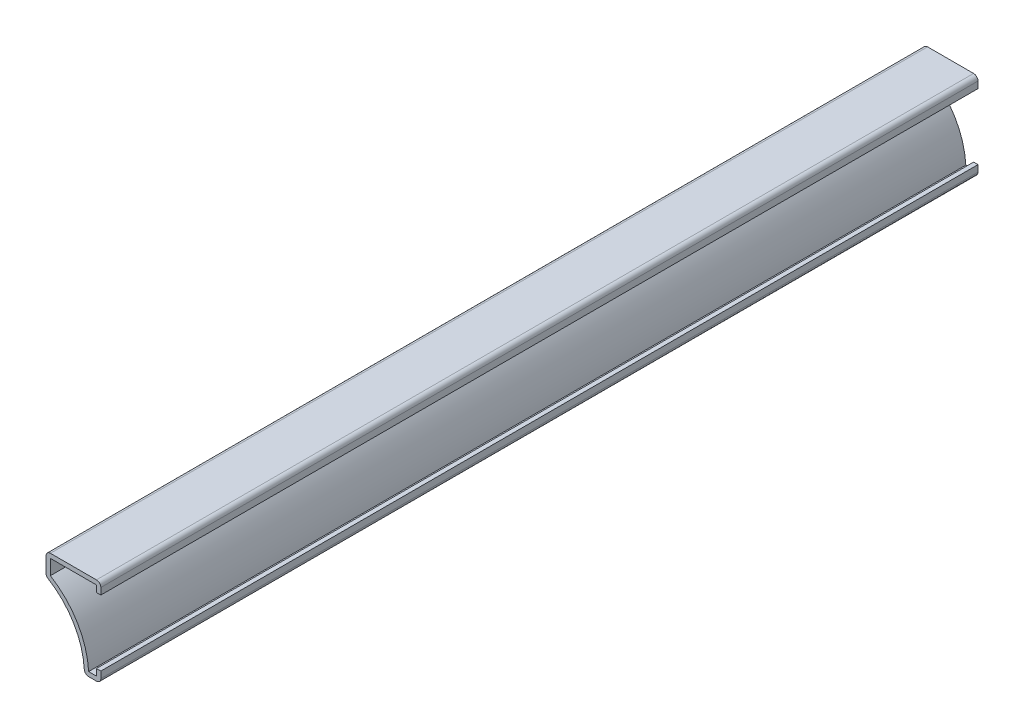
ISO-10303-21;
HEADER;
FILE_DESCRIPTION(('STEP AP214'),'2;1');
FILE_NAME('part.step','',(''),(''),'','','');
FILE_SCHEMA(('AUTOMOTIVE_DESIGN { 1 0 10303 214 1 1 1 1 }'));
ENDSEC;
DATA;
#1=APPLICATION_CONTEXT('core data for automotive mechanical design processes');
#2=APPLICATION_PROTOCOL_DEFINITION('international standard','automotive_design',2000,#1);
#3=PRODUCT_CONTEXT('',#1,'mechanical');
#4=PRODUCT('Part','Part','',(#3));
#5=PRODUCT_RELATED_PRODUCT_CATEGORY('part','',(#4));
#6=PRODUCT_DEFINITION_FORMATION('','',#4);
#7=PRODUCT_DEFINITION_CONTEXT('part definition',#1,'design');
#8=PRODUCT_DEFINITION('design','',#6,#7);
#9=PRODUCT_DEFINITION_SHAPE('','',#8);
#10=(LENGTH_UNIT() NAMED_UNIT(*) SI_UNIT(.MILLI.,.METRE.));
#11=(NAMED_UNIT(*) PLANE_ANGLE_UNIT() SI_UNIT($,.RADIAN.));
#12=(NAMED_UNIT(*) SI_UNIT($,.STERADIAN.) SOLID_ANGLE_UNIT());
#13=UNCERTAINTY_MEASURE_WITH_UNIT(LENGTH_MEASURE(1.E-05),#10,'distance_accuracy_value','');
#14=(GEOMETRIC_REPRESENTATION_CONTEXT(3) GLOBAL_UNCERTAINTY_ASSIGNED_CONTEXT((#13)) GLOBAL_UNIT_ASSIGNED_CONTEXT((#10,
#11,#12)) REPRESENTATION_CONTEXT('',''));
#15=CARTESIAN_POINT('',(0.,0.,0.));
#16=DIRECTION('',(0.,0.,1.));
#17=DIRECTION('',(1.,0.,0.));
#18=AXIS2_PLACEMENT_3D('',#15,#16,#17);
#19=CARTESIAN_POINT('',(-1.27,22.225,-254.));
#20=DIRECTION('',(-1.,0.,0.));
#21=DIRECTION('',(0.,-1.,0.));
#22=AXIS2_PLACEMENT_3D('',#19,#20,#21);
#23=PLANE('',#22);
#24=DIRECTION('',(0.,-1.,0.));
#25=VECTOR('',#24,1.);
#26=CARTESIAN_POINT('',(-1.27,22.225,0.));
#27=LINE('',#26,#25);
#28=CARTESIAN_POINT('',(-1.27,20.955,0.));
#29=VERTEX_POINT('',#28);
#30=CARTESIAN_POINT('',(-1.27,19.05,0.));
#31=VERTEX_POINT('',#30);
#32=EDGE_CURVE('E227',#29,#31,#27,.T.);
#33=ORIENTED_EDGE('',*,*,#32,.F.);
#34=DIRECTION('',(0.,0.,1.));
#35=VECTOR('',#34,1.);
#36=CARTESIAN_POINT('',(-1.27,20.955,-254.));
#37=LINE('',#36,#35);
#38=CARTESIAN_POINT('',(-1.27,20.955,-254.));
#39=VERTEX_POINT('',#38);
#40=EDGE_CURVE('E191',#39,#29,#37,.T.);
#41=ORIENTED_EDGE('',*,*,#40,.F.);
#42=DIRECTION('',(0.,-1.,0.));
#43=VECTOR('',#42,1.);
#44=CARTESIAN_POINT('',(-1.27,22.225,-254.));
#45=LINE('',#44,#43);
#46=CARTESIAN_POINT('',(-1.27,19.05,-254.));
#47=VERTEX_POINT('',#46);
#48=EDGE_CURVE('E173',#39,#47,#45,.T.);
#49=ORIENTED_EDGE('',*,*,#48,.T.);
#50=DIRECTION('',(0.,0.,1.));
#51=VECTOR('',#50,1.);
#52=CARTESIAN_POINT('',(-1.27,19.05,-254.));
#53=LINE('',#52,#51);
#54=EDGE_CURVE('E181',#47,#31,#53,.T.);
#55=ORIENTED_EDGE('',*,*,#54,.T.);
#56=EDGE_LOOP('',(#33,#41,#49,#55));
#57=FACE_BOUND('',#56,.T.);
#58=ADVANCED_FACE('F35',(#57),#23,.T.);
#59=CARTESIAN_POINT('',(-15.875,20.955,-254.));
#60=DIRECTION('',(0.,-1.,0.));
#61=DIRECTION('',(1.,0.,0.));
#62=AXIS2_PLACEMENT_3D('',#59,#60,#61);
#63=PLANE('',#62);
#64=DIRECTION('',(1.,0.,0.));
#65=VECTOR('',#64,1.);
#66=CARTESIAN_POINT('',(-15.875,20.955,0.));
#67=LINE('',#66,#65);
#68=CARTESIAN_POINT('',(-14.605,20.955,0.));
#69=VERTEX_POINT('',#68);
#70=EDGE_CURVE('E192',#69,#29,#67,.T.);
#71=ORIENTED_EDGE('',*,*,#70,.F.);
#72=DIRECTION('',(0.,0.,1.));
#73=VECTOR('',#72,1.);
#74=CARTESIAN_POINT('',(-14.605,20.955,-254.));
#75=LINE('',#74,#73);
#76=CARTESIAN_POINT('',(-14.605,20.955,-254.));
#77=VERTEX_POINT('',#76);
#78=EDGE_CURVE('E261',#77,#69,#75,.T.);
#79=ORIENTED_EDGE('',*,*,#78,.F.);
#80=DIRECTION('',(1.,0.,0.));
#81=VECTOR('',#80,1.);
#82=CARTESIAN_POINT('',(-15.875,20.955,-254.));
#83=LINE('',#82,#81);
#84=EDGE_CURVE('E189',#77,#39,#83,.T.);
#85=ORIENTED_EDGE('',*,*,#84,.T.);
#86=ORIENTED_EDGE('',*,*,#40,.T.);
#87=EDGE_LOOP('',(#71,#79,#85,#86));
#88=FACE_BOUND('',#87,.T.);
#89=ADVANCED_FACE('F328',(#88),#63,.T.);
#90=CARTESIAN_POINT('',(-14.605,15.875,-254.));
#91=DIRECTION('',(1.,0.,0.));
#92=DIRECTION('',(0.,0.,-1.));
#93=AXIS2_PLACEMENT_3D('',#90,#91,#92);
#94=PLANE('',#93);
#95=DIRECTION('',(0.,1.,0.));
#96=VECTOR('',#95,1.);
#97=CARTESIAN_POINT('',(-14.605,15.875,0.));
#98=LINE('',#97,#96);
#99=CARTESIAN_POINT('',(-14.605,16.6019626080447,0.));
#100=VERTEX_POINT('',#99);
#101=EDGE_CURVE('E195',#100,#69,#98,.T.);
#102=ORIENTED_EDGE('',*,*,#101,.F.);
#103=DIRECTION('',(0.,0.,1.));
#104=VECTOR('',#103,1.);
#105=CARTESIAN_POINT('',(-14.605,16.6019626080447,-254.));
#106=LINE('',#105,#104);
#107=CARTESIAN_POINT('',(-14.605,16.6019626080447,-254.));
#108=VERTEX_POINT('',#107);
#109=EDGE_CURVE('E263',#108,#100,#106,.T.);
#110=ORIENTED_EDGE('',*,*,#109,.F.);
#111=DIRECTION('',(0.,1.,0.));
#112=VECTOR('',#111,1.);
#113=CARTESIAN_POINT('',(-14.605,15.875,-254.));
#114=LINE('',#113,#112);
#115=EDGE_CURVE('E223',#108,#77,#114,.T.);
#116=ORIENTED_EDGE('',*,*,#115,.T.);
#117=ORIENTED_EDGE('',*,*,#78,.T.);
#118=EDGE_LOOP('',(#102,#110,#116,#117));
#119=FACE_BOUND('',#118,.T.);
#120=ADVANCED_FACE('F389',(#119),#94,.T.);
#121=CARTESIAN_POINT('',(-26.6473214285714,-3.175,-254.));
#122=DIRECTION('',(0.,0.,1.));
#123=DIRECTION('',(1.,0.,0.));
#124=AXIS2_PLACEMENT_3D('',#121,#122,#123);
#125=CYLINDRICAL_SURFACE('',#124,23.1548214285714);
#126=CARTESIAN_POINT('',(-26.6473214285714,-3.175,0.));
#127=DIRECTION('',(0.,0.,1.));
#128=DIRECTION('',(1.,0.,0.));
#129=AXIS2_PLACEMENT_3D('',#126,#127,#128);
#130=CIRCLE('',#129,23.1548214285714);
#131=CARTESIAN_POINT('',(-3.52735483281202,-1.905,0.));
#132=VERTEX_POINT('',#131);
#133=EDGE_CURVE('E254',#132,#100,#130,.T.);
#134=ORIENTED_EDGE('',*,*,#133,.F.);
#135=DIRECTION('',(0.,0.,1.));
#136=VECTOR('',#135,1.);
#137=CARTESIAN_POINT('',(-3.52735483281202,-1.905,-254.));
#138=LINE('',#137,#136);
#139=CARTESIAN_POINT('',(-3.52735483281202,-1.905,-254.));
#140=VERTEX_POINT('',#139);
#141=EDGE_CURVE('E265',#140,#132,#138,.T.);
#142=ORIENTED_EDGE('',*,*,#141,.F.);
#143=CARTESIAN_POINT('',(-26.6473214285714,-3.175,-254.));
#144=DIRECTION('',(0.,0.,1.));
#145=DIRECTION('',(1.,0.,0.));
#146=AXIS2_PLACEMENT_3D('',#143,#144,#145);
#147=CIRCLE('',#146,23.1548214285714);
#148=EDGE_CURVE('E220',#140,#108,#147,.T.);
#149=ORIENTED_EDGE('',*,*,#148,.T.);
#150=ORIENTED_EDGE('',*,*,#109,.T.);
#151=EDGE_LOOP('',(#134,#142,#149,#150));
#152=FACE_BOUND('',#151,.T.);
#153=ADVANCED_FACE('F335',(#152),#125,.T.);
#154=CARTESIAN_POINT('',(0.,-1.905,-254.));
#155=DIRECTION('',(0.,1.,0.));
#156=DIRECTION('',(-1.,0.,0.));
#157=AXIS2_PLACEMENT_3D('',#154,#155,#156);
#158=PLANE('',#157);
#159=DIRECTION('',(-1.,0.,0.));
#160=VECTOR('',#159,1.);
#161=CARTESIAN_POINT('',(0.,-1.905,0.));
#162=LINE('',#161,#160);
#163=CARTESIAN_POINT('',(-1.27,-1.905,0.));
#164=VERTEX_POINT('',#163);
#165=EDGE_CURVE('E251',#164,#132,#162,.T.);
#166=ORIENTED_EDGE('',*,*,#165,.F.);
#167=DIRECTION('',(0.,0.,1.));
#168=VECTOR('',#167,1.);
#169=CARTESIAN_POINT('',(-1.27,-1.905,-254.));
#170=LINE('',#169,#168);
#171=CARTESIAN_POINT('',(-1.27,-1.905,-254.));
#172=VERTEX_POINT('',#171);
#173=EDGE_CURVE('E267',#172,#164,#170,.T.);
#174=ORIENTED_EDGE('',*,*,#173,.F.);
#175=DIRECTION('',(-1.,0.,0.));
#176=VECTOR('',#175,1.);
#177=CARTESIAN_POINT('',(0.,-1.905,-254.));
#178=LINE('',#177,#176);
#179=EDGE_CURVE('E217',#172,#140,#178,.T.);
#180=ORIENTED_EDGE('',*,*,#179,.T.);
#181=ORIENTED_EDGE('',*,*,#141,.T.);
#182=EDGE_LOOP('',(#166,#174,#180,#181));
#183=FACE_BOUND('',#182,.T.);
#184=ADVANCED_FACE('F338',(#183),#158,.T.);
#185=CARTESIAN_POINT('',(-1.27,0.,-254.));
#186=DIRECTION('',(-1.,0.,0.));
#187=DIRECTION('',(0.,-1.,0.));
#188=AXIS2_PLACEMENT_3D('',#185,#186,#187);
#189=PLANE('',#188);
#190=DIRECTION('',(0.,-1.,0.));
#191=VECTOR('',#190,1.);
#192=CARTESIAN_POINT('',(-1.27,0.,0.));
#193=LINE('',#192,#191);
#194=CARTESIAN_POINT('',(-1.27,0.,0.));
#195=VERTEX_POINT('',#194);
#196=EDGE_CURVE('E248',#195,#164,#193,.T.);
#197=ORIENTED_EDGE('',*,*,#196,.F.);
#198=DIRECTION('',(0.,0.,1.));
#199=VECTOR('',#198,1.);
#200=CARTESIAN_POINT('',(-1.27,0.,-254.));
#201=LINE('',#200,#199);
#202=CARTESIAN_POINT('',(-1.27,0.,-254.));
#203=VERTEX_POINT('',#202);
#204=EDGE_CURVE('E269',#203,#195,#201,.T.);
#205=ORIENTED_EDGE('',*,*,#204,.F.);
#206=DIRECTION('',(0.,-1.,0.));
#207=VECTOR('',#206,1.);
#208=CARTESIAN_POINT('',(-1.27,0.,-254.));
#209=LINE('',#208,#207);
#210=EDGE_CURVE('E214',#203,#172,#209,.T.);
#211=ORIENTED_EDGE('',*,*,#210,.T.);
#212=ORIENTED_EDGE('',*,*,#173,.T.);
#213=EDGE_LOOP('',(#197,#205,#211,#212));
#214=FACE_BOUND('',#213,.T.);
#215=ADVANCED_FACE('F342',(#214),#189,.T.);
#216=CARTESIAN_POINT('',(-1.27,0.,-254.));
#217=DIRECTION('',(0.,-1.,0.));
#218=DIRECTION('',(1.,0.,0.));
#219=AXIS2_PLACEMENT_3D('',#216,#217,#218);
#220=PLANE('',#219);
#221=DIRECTION('',(1.,0.,0.));
#222=VECTOR('',#221,1.);
#223=CARTESIAN_POINT('',(-1.27,0.,0.));
#224=LINE('',#223,#222);
#225=CARTESIAN_POINT('',(0.,0.,0.));
#226=VERTEX_POINT('',#225);
#227=EDGE_CURVE('E246',#195,#226,#224,.T.);
#228=ORIENTED_EDGE('',*,*,#227,.T.);
#229=DIRECTION('',(0.,0.,1.));
#230=VECTOR('',#229,1.);
#231=CARTESIAN_POINT('',(0.,0.,-254.));
#232=LINE('',#231,#230);
#233=CARTESIAN_POINT('',(0.,0.,-254.));
#234=VERTEX_POINT('',#233);
#235=EDGE_CURVE('E271',#234,#226,#232,.T.);
#236=ORIENTED_EDGE('',*,*,#235,.F.);
#237=DIRECTION('',(1.,0.,0.));
#238=VECTOR('',#237,1.);
#239=CARTESIAN_POINT('',(-1.27,0.,-254.));
#240=LINE('',#239,#238);
#241=EDGE_CURVE('E212',#203,#234,#240,.T.);
#242=ORIENTED_EDGE('',*,*,#241,.F.);
#243=ORIENTED_EDGE('',*,*,#204,.T.);
#244=EDGE_LOOP('',(#228,#236,#242,#243));
#245=FACE_BOUND('',#244,.T.);
#246=ADVANCED_FACE('F347',(#245),#220,.F.);
#247=CARTESIAN_POINT('',(0.,0.,-254.));
#248=DIRECTION('',(-1.,0.,0.));
#249=DIRECTION('',(0.,-1.,0.));
#250=AXIS2_PLACEMENT_3D('',#247,#248,#249);
#251=PLANE('',#250);
#252=DIRECTION('',(0.,-1.,0.));
#253=VECTOR('',#252,1.);
#254=CARTESIAN_POINT('',(0.,0.,0.));
#255=LINE('',#254,#253);
#256=CARTESIAN_POINT('',(0.,-1.905,0.));
#257=VERTEX_POINT('',#256);
#258=EDGE_CURVE('E243',#226,#257,#255,.T.);
#259=ORIENTED_EDGE('',*,*,#258,.T.);
#260=DIRECTION('',(0.,0.,1.));
#261=VECTOR('',#260,1.);
#262=CARTESIAN_POINT('',(0.,-1.905,-254.));
#263=LINE('',#262,#261);
#264=CARTESIAN_POINT('',(0.,-1.905,-254.));
#265=VERTEX_POINT('',#264);
#266=EDGE_CURVE('E289',#257,#265,#263,.F.);
#267=ORIENTED_EDGE('',*,*,#266,.T.);
#268=DIRECTION('',(0.,-1.,0.));
#269=VECTOR('',#268,1.);
#270=CARTESIAN_POINT('',(0.,0.,-254.));
#271=LINE('',#270,#269);
#272=EDGE_CURVE('E210',#234,#265,#271,.T.);
#273=ORIENTED_EDGE('',*,*,#272,.F.);
#274=ORIENTED_EDGE('',*,*,#235,.T.);
#275=EDGE_LOOP('',(#259,#267,#273,#274));
#276=FACE_BOUND('',#275,.T.);
#277=ADVANCED_FACE('F481',(#276),#251,.F.);
#278=CARTESIAN_POINT('',(0.,-3.175,-254.));
#279=DIRECTION('',(0.,1.,0.));
#280=DIRECTION('',(-1.,0.,0.));
#281=AXIS2_PLACEMENT_3D('',#278,#279,#280);
#282=PLANE('',#281);
#283=DIRECTION('',(-1.,0.,0.));
#284=VECTOR('',#283,1.);
#285=CARTESIAN_POINT('',(0.,-3.175,-254.));
#286=LINE('',#285,#284);
#287=CARTESIAN_POINT('',(-1.27,-3.175,-254.));
#288=VERTEX_POINT('',#287);
#289=CARTESIAN_POINT('',(-3.52735483281202,-3.175,-254.));
#290=VERTEX_POINT('',#289);
#291=EDGE_CURVE('E207',#288,#290,#286,.T.);
#292=ORIENTED_EDGE('',*,*,#291,.F.);
#293=DIRECTION('',(0.,0.,1.));
#294=VECTOR('',#293,1.);
#295=CARTESIAN_POINT('',(-1.27,-3.175,-254.));
#296=LINE('',#295,#294);
#297=CARTESIAN_POINT('',(-1.27,-3.175,0.));
#298=VERTEX_POINT('',#297);
#299=EDGE_CURVE('E276',#288,#298,#296,.T.);
#300=ORIENTED_EDGE('',*,*,#299,.T.);
#301=DIRECTION('',(-1.,0.,0.));
#302=VECTOR('',#301,1.);
#303=CARTESIAN_POINT('',(0.,-3.175,0.));
#304=LINE('',#303,#302);
#305=CARTESIAN_POINT('',(-3.52735483281202,-3.175,0.));
#306=VERTEX_POINT('',#305);
#307=EDGE_CURVE('E240',#298,#306,#304,.T.);
#308=ORIENTED_EDGE('',*,*,#307,.T.);
#309=DIRECTION('',(0.,0.,1.));
#310=VECTOR('',#309,1.);
#311=CARTESIAN_POINT('',(-3.52735483281202,-3.175,-254.));
#312=LINE('',#311,#310);
#313=EDGE_CURVE('E260',#306,#290,#312,.F.);
#314=ORIENTED_EDGE('',*,*,#313,.T.);
#315=EDGE_LOOP('',(#292,#300,#308,#314));
#316=FACE_BOUND('',#315,.T.);
#317=ADVANCED_FACE('F357',(#316),#282,.F.);
#318=CARTESIAN_POINT('',(-26.6473214285714,-3.175,-254.));
#319=DIRECTION('',(0.,0.,1.));
#320=DIRECTION('',(1.,0.,0.));
#321=AXIS2_PLACEMENT_3D('',#318,#319,#320);
#322=CYLINDRICAL_SURFACE('',#321,21.8848214285714);
#323=CARTESIAN_POINT('',(-26.6473214285714,-3.175,-254.));
#324=DIRECTION('',(0.,0.,1.));
#325=DIRECTION('',(1.,0.,0.));
#326=AXIS2_PLACEMENT_3D('',#323,#324,#325);
#327=CIRCLE('',#326,21.8848214285714);
#328=CARTESIAN_POINT('',(-4.79544310838747,-1.97465719882468,-254.));
#329=VERTEX_POINT('',#328);
#330=CARTESIAN_POINT('',(-15.265499510284,15.5172320438425,-254.));
#331=VERTEX_POINT('',#330);
#332=EDGE_CURVE('E204',#329,#331,#327,.T.);
#333=ORIENTED_EDGE('',*,*,#332,.F.);
#334=DIRECTION('',(0.,0.,1.));
#335=VECTOR('',#334,1.);
#336=CARTESIAN_POINT('',(-4.79544310838747,-1.97465719882468,-254.));
#337=LINE('',#336,#335);
#338=CARTESIAN_POINT('',(-4.79544310838747,-1.97465719882468,0.));
#339=VERTEX_POINT('',#338);
#340=EDGE_CURVE('E302',#329,#339,#337,.T.);
#341=ORIENTED_EDGE('',*,*,#340,.T.);
#342=CARTESIAN_POINT('',(-26.6473214285714,-3.175,0.));
#343=DIRECTION('',(0.,0.,1.));
#344=DIRECTION('',(1.,0.,0.));
#345=AXIS2_PLACEMENT_3D('',#342,#343,#344);
#346=CIRCLE('',#345,21.8848214285714);
#347=CARTESIAN_POINT('',(-15.265499510284,15.5172320438425,0.));
#348=VERTEX_POINT('',#347);
#349=EDGE_CURVE('E237',#339,#348,#346,.T.);
#350=ORIENTED_EDGE('',*,*,#349,.T.);
#351=DIRECTION('',(0.,0.,1.));
#352=VECTOR('',#351,1.);
#353=CARTESIAN_POINT('',(-15.265499510284,15.5172320438425,-254.));
#354=LINE('',#353,#352);
#355=EDGE_CURVE('E300',#348,#331,#354,.F.);
#356=ORIENTED_EDGE('',*,*,#355,.T.);
#357=EDGE_LOOP('',(#333,#341,#350,#356));
#358=FACE_BOUND('',#357,.T.);
#359=ADVANCED_FACE('F367',(#358),#322,.F.);
#360=CARTESIAN_POINT('',(-15.875,15.875,-254.));
#361=DIRECTION('',(1.,0.,0.));
#362=DIRECTION('',(0.,0.,-1.));
#363=AXIS2_PLACEMENT_3D('',#360,#361,#362);
#364=PLANE('',#363);
#365=DIRECTION('',(0.,1.,0.));
#366=VECTOR('',#365,1.);
#367=CARTESIAN_POINT('',(-15.875,15.875,-254.));
#368=LINE('',#367,#366);
#369=CARTESIAN_POINT('',(-15.875,16.6019626080447,-254.));
#370=VERTEX_POINT('',#369);
#371=CARTESIAN_POINT('',(-15.875,20.955,-254.));
#372=VERTEX_POINT('',#371);
#373=EDGE_CURVE('E201',#370,#372,#368,.T.);
#374=ORIENTED_EDGE('',*,*,#373,.F.);
#375=DIRECTION('',(0.,0.,1.));
#376=VECTOR('',#375,1.);
#377=CARTESIAN_POINT('',(-15.875,16.6019626080447,-254.));
#378=LINE('',#377,#376);
#379=CARTESIAN_POINT('',(-15.875,16.6019626080447,0.));
#380=VERTEX_POINT('',#379);
#381=EDGE_CURVE('E307',#370,#380,#378,.T.);
#382=ORIENTED_EDGE('',*,*,#381,.T.);
#383=DIRECTION('',(0.,1.,0.));
#384=VECTOR('',#383,1.);
#385=CARTESIAN_POINT('',(-15.875,15.875,0.));
#386=LINE('',#385,#384);
#387=CARTESIAN_POINT('',(-15.875,20.955,0.));
#388=VERTEX_POINT('',#387);
#389=EDGE_CURVE('E234',#380,#388,#386,.T.);
#390=ORIENTED_EDGE('',*,*,#389,.T.);
#391=DIRECTION('',(0.,0.,1.));
#392=VECTOR('',#391,1.);
#393=CARTESIAN_POINT('',(-15.875,20.955,-254.));
#394=LINE('',#393,#392);
#395=EDGE_CURVE('E305',#388,#372,#394,.F.);
#396=ORIENTED_EDGE('',*,*,#395,.T.);
#397=EDGE_LOOP('',(#374,#382,#390,#396));
#398=FACE_BOUND('',#397,.T.);
#399=ADVANCED_FACE('F375',(#398),#364,.F.);
#400=CARTESIAN_POINT('',(-15.875,22.225,-254.));
#401=DIRECTION('',(0.,-1.,0.));
#402=DIRECTION('',(1.,0.,0.));
#403=AXIS2_PLACEMENT_3D('',#400,#401,#402);
#404=PLANE('',#403);
#405=DIRECTION('',(1.,0.,0.));
#406=VECTOR('',#405,1.);
#407=CARTESIAN_POINT('',(-15.875,22.225,-254.));
#408=LINE('',#407,#406);
#409=CARTESIAN_POINT('',(-14.605,22.225,-254.));
#410=VERTEX_POINT('',#409);
#411=CARTESIAN_POINT('',(-1.27,22.225,-254.));
#412=VERTEX_POINT('',#411);
#413=EDGE_CURVE('E199',#410,#412,#408,.T.);
#414=ORIENTED_EDGE('',*,*,#413,.F.);
#415=DIRECTION('',(0.,0.,1.));
#416=VECTOR('',#415,1.);
#417=CARTESIAN_POINT('',(-14.605,22.225,-254.));
#418=LINE('',#417,#416);
#419=CARTESIAN_POINT('',(-14.605,22.225,0.));
#420=VERTEX_POINT('',#419);
#421=EDGE_CURVE('E43',#410,#420,#418,.T.);
#422=ORIENTED_EDGE('',*,*,#421,.T.);
#423=DIRECTION('',(1.,0.,0.));
#424=VECTOR('',#423,1.);
#425=CARTESIAN_POINT('',(-15.875,22.225,0.));
#426=LINE('',#425,#424);
#427=CARTESIAN_POINT('',(-1.27,22.225,0.));
#428=VERTEX_POINT('',#427);
#429=EDGE_CURVE('E232',#420,#428,#426,.T.);
#430=ORIENTED_EDGE('',*,*,#429,.T.);
#431=DIRECTION('',(0.,0.,1.));
#432=VECTOR('',#431,1.);
#433=CARTESIAN_POINT('',(-1.27,22.225,-254.));
#434=LINE('',#433,#432);
#435=EDGE_CURVE('E58',#428,#412,#434,.F.);
#436=ORIENTED_EDGE('',*,*,#435,.T.);
#437=EDGE_LOOP('',(#414,#422,#430,#436));
#438=FACE_BOUND('',#437,.T.);
#439=ADVANCED_FACE('F313',(#438),#404,.F.);
#440=CARTESIAN_POINT('',(0.,22.225,-254.));
#441=DIRECTION('',(-1.,0.,0.));
#442=DIRECTION('',(0.,-1.,0.));
#443=AXIS2_PLACEMENT_3D('',#440,#441,#442);
#444=PLANE('',#443);
#445=DIRECTION('',(0.,-1.,0.));
#446=VECTOR('',#445,1.);
#447=CARTESIAN_POINT('',(0.,22.225,-254.));
#448=LINE('',#447,#446);
#449=CARTESIAN_POINT('',(0.,20.955,-254.));
#450=VERTEX_POINT('',#449);
#451=CARTESIAN_POINT('',(0.,19.05,-254.));
#452=VERTEX_POINT('',#451);
#453=EDGE_CURVE('E175',#450,#452,#448,.T.);
#454=ORIENTED_EDGE('',*,*,#453,.F.);
#455=DIRECTION('',(0.,0.,1.));
#456=VECTOR('',#455,1.);
#457=CARTESIAN_POINT('',(0.,20.955,-254.));
#458=LINE('',#457,#456);
#459=CARTESIAN_POINT('',(0.,20.955,0.));
#460=VERTEX_POINT('',#459);
#461=EDGE_CURVE('E11',#450,#460,#458,.T.);
#462=ORIENTED_EDGE('',*,*,#461,.T.);
#463=DIRECTION('',(0.,-1.,0.));
#464=VECTOR('',#463,1.);
#465=CARTESIAN_POINT('',(0.,22.225,0.));
#466=LINE('',#465,#464);
#467=CARTESIAN_POINT('',(0.,19.05,0.));
#468=VERTEX_POINT('',#467);
#469=EDGE_CURVE('E230',#460,#468,#466,.T.);
#470=ORIENTED_EDGE('',*,*,#469,.T.);
#471=DIRECTION('',(0.,0.,1.));
#472=VECTOR('',#471,1.);
#473=CARTESIAN_POINT('',(0.,19.05,-254.));
#474=LINE('',#473,#472);
#475=EDGE_CURVE('E188',#452,#468,#474,.T.);
#476=ORIENTED_EDGE('',*,*,#475,.F.);
#477=EDGE_LOOP('',(#454,#462,#470,#476));
#478=FACE_BOUND('',#477,.T.);
#479=ADVANCED_FACE('F324',(#478),#444,.F.);
#480=CARTESIAN_POINT('',(0.,19.05,-254.));
#481=DIRECTION('',(0.,1.,0.));
#482=DIRECTION('',(0.,0.,1.));
#483=AXIS2_PLACEMENT_3D('',#480,#481,#482);
#484=PLANE('',#483);
#485=DIRECTION('',(-1.,0.,0.));
#486=VECTOR('',#485,1.);
#487=CARTESIAN_POINT('',(0.,19.05,0.));
#488=LINE('',#487,#486);
#489=EDGE_CURVE('E184',#468,#31,#488,.T.);
#490=ORIENTED_EDGE('',*,*,#489,.T.);
#491=ORIENTED_EDGE('',*,*,#54,.F.);
#492=DIRECTION('',(-1.,0.,0.));
#493=VECTOR('',#492,1.);
#494=CARTESIAN_POINT('',(0.,19.05,-254.));
#495=LINE('',#494,#493);
#496=EDGE_CURVE('E167',#452,#47,#495,.T.);
#497=ORIENTED_EDGE('',*,*,#496,.F.);
#498=ORIENTED_EDGE('',*,*,#475,.T.);
#499=EDGE_LOOP('',(#490,#491,#497,#498));
#500=FACE_BOUND('',#499,.T.);
#501=ADVANCED_FACE('F182',(#500),#484,.F.);
#502=CARTESIAN_POINT('',(-26.6473214285714,-3.175,-254.));
#503=DIRECTION('',(0.,0.,1.));
#504=DIRECTION('',(1.,0.,0.));
#505=AXIS2_PLACEMENT_3D('',#502,#503,#504);
#506=PLANE('',#505);
#507=ORIENTED_EDGE('',*,*,#272,.T.);
#508=CARTESIAN_POINT('',(-1.27,-1.905,-254.));
#509=DIRECTION('',(0.,0.,1.));
#510=DIRECTION('',(1.,0.,0.));
#511=AXIS2_PLACEMENT_3D('',#508,#509,#510);
#512=CIRCLE('',#511,1.27);
#513=EDGE_CURVE('E298',#265,#288,#512,.F.);
#514=ORIENTED_EDGE('',*,*,#513,.T.);
#515=ORIENTED_EDGE('',*,*,#291,.T.);
#516=CARTESIAN_POINT('',(-3.52735483281202,-1.905,-254.));
#517=DIRECTION('',(0.,0.,1.));
#518=DIRECTION('',(1.,0.,0.));
#519=AXIS2_PLACEMENT_3D('',#516,#517,#518);
#520=CIRCLE('',#519,1.27);
#521=EDGE_CURVE('E296',#290,#329,#520,.F.);
#522=ORIENTED_EDGE('',*,*,#521,.T.);
#523=ORIENTED_EDGE('',*,*,#332,.T.);
#524=CARTESIAN_POINT('',(-14.605,16.6019626080447,-254.));
#525=DIRECTION('',(0.,0.,1.));
#526=DIRECTION('',(1.,0.,0.));
#527=AXIS2_PLACEMENT_3D('',#524,#525,#526);
#528=CIRCLE('',#527,1.27);
#529=EDGE_CURVE('E294',#331,#370,#528,.F.);
#530=ORIENTED_EDGE('',*,*,#529,.T.);
#531=ORIENTED_EDGE('',*,*,#373,.T.);
#532=CARTESIAN_POINT('',(-14.605,20.955,-254.));
#533=DIRECTION('',(0.,0.,1.));
#534=DIRECTION('',(1.,0.,0.));
#535=AXIS2_PLACEMENT_3D('',#532,#533,#534);
#536=CIRCLE('',#535,1.27);
#537=EDGE_CURVE('E292',#372,#410,#536,.F.);
#538=ORIENTED_EDGE('',*,*,#537,.T.);
#539=ORIENTED_EDGE('',*,*,#413,.T.);
#540=CARTESIAN_POINT('',(-1.27,20.955,-254.));
#541=DIRECTION('',(0.,0.,1.));
#542=DIRECTION('',(1.,0.,0.));
#543=AXIS2_PLACEMENT_3D('',#540,#541,#542);
#544=CIRCLE('',#543,1.27);
#545=EDGE_CURVE('E50',#412,#450,#544,.F.);
#546=ORIENTED_EDGE('',*,*,#545,.T.);
#547=ORIENTED_EDGE('',*,*,#453,.T.);
#548=ORIENTED_EDGE('',*,*,#496,.T.);
#549=ORIENTED_EDGE('',*,*,#48,.F.);
#550=ORIENTED_EDGE('',*,*,#84,.F.);
#551=ORIENTED_EDGE('',*,*,#115,.F.);
#552=ORIENTED_EDGE('',*,*,#148,.F.);
#553=ORIENTED_EDGE('',*,*,#179,.F.);
#554=ORIENTED_EDGE('',*,*,#210,.F.);
#555=ORIENTED_EDGE('',*,*,#241,.T.);
#556=EDGE_LOOP('',(#507,#514,#515,#522,#523,#530,#531,#538,#539,#546,#547,#548,#549,#550,#551,
#552,#553,#554,#555));
#557=FACE_BOUND('',#556,.T.);
#558=ADVANCED_FACE('F170',(#557),#506,.F.);
#559=CARTESIAN_POINT('',(-26.6473214285714,-3.175,0.));
#560=DIRECTION('',(0.,0.,1.));
#561=DIRECTION('',(1.,0.,0.));
#562=AXIS2_PLACEMENT_3D('',#559,#560,#561);
#563=PLANE('',#562);
#564=ORIENTED_EDGE('',*,*,#307,.F.);
#565=CARTESIAN_POINT('',(-1.27,-1.905,0.));
#566=DIRECTION('',(0.,0.,1.));
#567=DIRECTION('',(1.,0.,0.));
#568=AXIS2_PLACEMENT_3D('',#565,#566,#567);
#569=CIRCLE('',#568,1.27);
#570=EDGE_CURVE('E287',#298,#257,#569,.T.);
#571=ORIENTED_EDGE('',*,*,#570,.T.);
#572=ORIENTED_EDGE('',*,*,#258,.F.);
#573=ORIENTED_EDGE('',*,*,#227,.F.);
#574=ORIENTED_EDGE('',*,*,#196,.T.);
#575=ORIENTED_EDGE('',*,*,#165,.T.);
#576=ORIENTED_EDGE('',*,*,#133,.T.);
#577=ORIENTED_EDGE('',*,*,#101,.T.);
#578=ORIENTED_EDGE('',*,*,#70,.T.);
#579=ORIENTED_EDGE('',*,*,#32,.T.);
#580=ORIENTED_EDGE('',*,*,#489,.F.);
#581=ORIENTED_EDGE('',*,*,#469,.F.);
#582=CARTESIAN_POINT('',(-1.27,20.955,0.));
#583=DIRECTION('',(0.,0.,1.));
#584=DIRECTION('',(1.,0.,0.));
#585=AXIS2_PLACEMENT_3D('',#582,#583,#584);
#586=CIRCLE('',#585,1.27);
#587=EDGE_CURVE('E279',#460,#428,#586,.T.);
#588=ORIENTED_EDGE('',*,*,#587,.T.);
#589=ORIENTED_EDGE('',*,*,#429,.F.);
#590=CARTESIAN_POINT('',(-14.605,20.955,0.));
#591=DIRECTION('',(0.,0.,1.));
#592=DIRECTION('',(1.,0.,0.));
#593=AXIS2_PLACEMENT_3D('',#590,#591,#592);
#594=CIRCLE('',#593,1.27);
#595=EDGE_CURVE('E281',#420,#388,#594,.T.);
#596=ORIENTED_EDGE('',*,*,#595,.T.);
#597=ORIENTED_EDGE('',*,*,#389,.F.);
#598=CARTESIAN_POINT('',(-14.605,16.6019626080447,0.));
#599=DIRECTION('',(0.,0.,1.));
#600=DIRECTION('',(1.,0.,0.));
#601=AXIS2_PLACEMENT_3D('',#598,#599,#600);
#602=CIRCLE('',#601,1.27);
#603=EDGE_CURVE('E283',#380,#348,#602,.T.);
#604=ORIENTED_EDGE('',*,*,#603,.T.);
#605=ORIENTED_EDGE('',*,*,#349,.F.);
#606=CARTESIAN_POINT('',(-3.52735483281202,-1.905,0.));
#607=DIRECTION('',(0.,0.,1.));
#608=DIRECTION('',(1.,0.,0.));
#609=AXIS2_PLACEMENT_3D('',#606,#607,#608);
#610=CIRCLE('',#609,1.27);
#611=EDGE_CURVE('E285',#339,#306,#610,.T.);
#612=ORIENTED_EDGE('',*,*,#611,.T.);
#613=EDGE_LOOP('',(#564,#571,#572,#573,#574,#575,#576,#577,#578,#579,#580,#581,#588,#589,#596,
#597,#604,#605,#612));
#614=FACE_BOUND('',#613,.T.);
#615=ADVANCED_FACE('F318',(#614),#563,.T.);
#616=CARTESIAN_POINT('',(-1.27,-1.905,-254.));
#617=DIRECTION('',(0.,0.,1.));
#618=DIRECTION('',(1.,0.,0.));
#619=AXIS2_PLACEMENT_3D('',#616,#617,#618);
#620=CYLINDRICAL_SURFACE('',#619,1.27);
#621=ORIENTED_EDGE('',*,*,#513,.F.);
#622=ORIENTED_EDGE('',*,*,#266,.F.);
#623=ORIENTED_EDGE('',*,*,#570,.F.);
#624=ORIENTED_EDGE('',*,*,#299,.F.);
#625=EDGE_LOOP('',(#621,#622,#623,#624));
#626=FACE_BOUND('',#625,.T.);
#627=ADVANCED_FACE('F355',(#626),#620,.T.);
#628=CARTESIAN_POINT('',(-3.52735483281202,-1.905,-254.));
#629=DIRECTION('',(0.,0.,1.));
#630=DIRECTION('',(1.,0.,0.));
#631=AXIS2_PLACEMENT_3D('',#628,#629,#630);
#632=CYLINDRICAL_SURFACE('',#631,1.27);
#633=ORIENTED_EDGE('',*,*,#521,.F.);
#634=ORIENTED_EDGE('',*,*,#313,.F.);
#635=ORIENTED_EDGE('',*,*,#611,.F.);
#636=ORIENTED_EDGE('',*,*,#340,.F.);
#637=EDGE_LOOP('',(#633,#634,#635,#636));
#638=FACE_BOUND('',#637,.T.);
#639=ADVANCED_FACE('F364',(#638),#632,.T.);
#640=CARTESIAN_POINT('',(-14.605,16.6019626080447,-254.));
#641=DIRECTION('',(0.,0.,1.));
#642=DIRECTION('',(1.,0.,0.));
#643=AXIS2_PLACEMENT_3D('',#640,#641,#642);
#644=CYLINDRICAL_SURFACE('',#643,1.27);
#645=ORIENTED_EDGE('',*,*,#529,.F.);
#646=ORIENTED_EDGE('',*,*,#355,.F.);
#647=ORIENTED_EDGE('',*,*,#603,.F.);
#648=ORIENTED_EDGE('',*,*,#381,.F.);
#649=EDGE_LOOP('',(#645,#646,#647,#648));
#650=FACE_BOUND('',#649,.T.);
#651=ADVANCED_FACE('F373',(#650),#644,.T.);
#652=CARTESIAN_POINT('',(-14.605,20.955,-254.));
#653=DIRECTION('',(0.,0.,1.));
#654=DIRECTION('',(1.,0.,0.));
#655=AXIS2_PLACEMENT_3D('',#652,#653,#654);
#656=CYLINDRICAL_SURFACE('',#655,1.27);
#657=ORIENTED_EDGE('',*,*,#537,.F.);
#658=ORIENTED_EDGE('',*,*,#395,.F.);
#659=ORIENTED_EDGE('',*,*,#595,.F.);
#660=ORIENTED_EDGE('',*,*,#421,.F.);
#661=EDGE_LOOP('',(#657,#658,#659,#660));
#662=FACE_BOUND('',#661,.T.);
#663=ADVANCED_FACE('F377',(#662),#656,.T.);
#664=CARTESIAN_POINT('',(-1.27,20.955,-254.));
#665=DIRECTION('',(0.,0.,1.));
#666=DIRECTION('',(1.,0.,0.));
#667=AXIS2_PLACEMENT_3D('',#664,#665,#666);
#668=CYLINDRICAL_SURFACE('',#667,1.27);
#669=ORIENTED_EDGE('',*,*,#545,.F.);
#670=ORIENTED_EDGE('',*,*,#435,.F.);
#671=ORIENTED_EDGE('',*,*,#587,.F.);
#672=ORIENTED_EDGE('',*,*,#461,.F.);
#673=EDGE_LOOP('',(#669,#670,#671,#672));
#674=FACE_BOUND('',#673,.T.);
#675=ADVANCED_FACE('F37',(#674),#668,.T.);
#676=CLOSED_SHELL('',(#58,#89,#120,#153,#184,#215,#246,#277,#317,#359,#399,#439,#479,#501,#558,
#615,#627,#639,#651,#663,#675));
#677=MANIFOLD_SOLID_BREP('B2',#676);
#678=ADVANCED_BREP_SHAPE_REPRESENTATION('',(#18,#677),#14);
#679=SHAPE_DEFINITION_REPRESENTATION(#9,#678);
ENDSEC;
END-ISO-10303-21;
